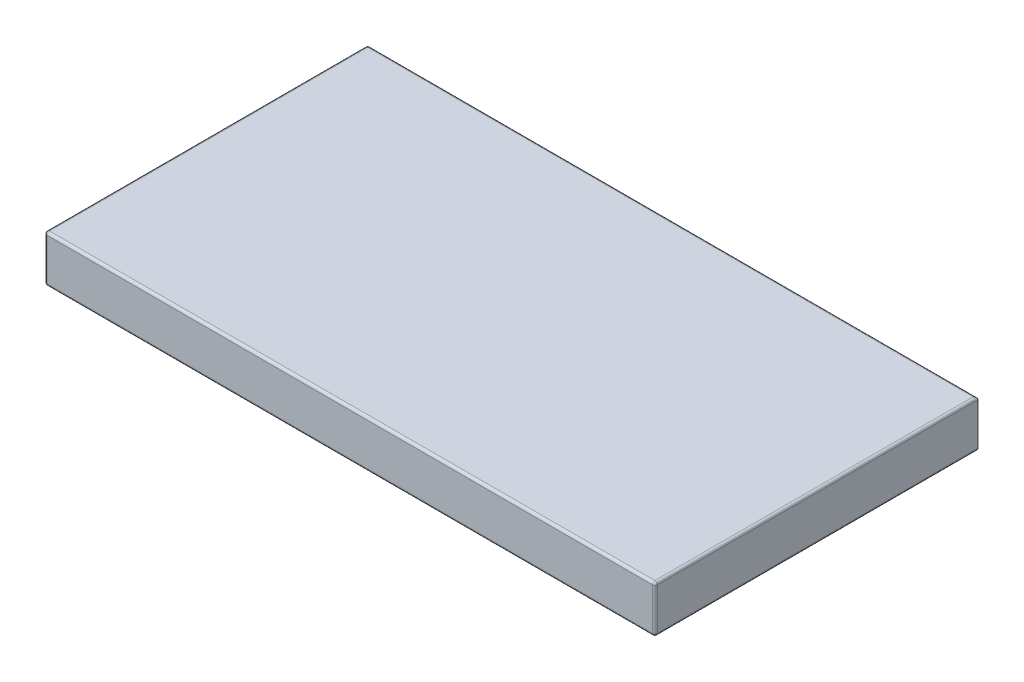
ISO-10303-21;
HEADER;
FILE_DESCRIPTION(('STEP AP214'),'2;1');
FILE_NAME('part.step','',(''),(''),'','','');
FILE_SCHEMA(('AUTOMOTIVE_DESIGN { 1 0 10303 214 1 1 1 1 }'));
ENDSEC;
DATA;
#1=APPLICATION_CONTEXT('core data for automotive mechanical design processes');
#2=APPLICATION_PROTOCOL_DEFINITION('international standard','automotive_design',2000,#1);
#3=PRODUCT_CONTEXT('',#1,'mechanical');
#4=PRODUCT('Part','Part','',(#3));
#5=PRODUCT_RELATED_PRODUCT_CATEGORY('part','',(#4));
#6=PRODUCT_DEFINITION_FORMATION('','',#4);
#7=PRODUCT_DEFINITION_CONTEXT('part definition',#1,'design');
#8=PRODUCT_DEFINITION('design','',#6,#7);
#9=PRODUCT_DEFINITION_SHAPE('','',#8);
#10=(LENGTH_UNIT() NAMED_UNIT(*) SI_UNIT(.MILLI.,.METRE.));
#11=(NAMED_UNIT(*) PLANE_ANGLE_UNIT() SI_UNIT($,.RADIAN.));
#12=(NAMED_UNIT(*) SI_UNIT($,.STERADIAN.) SOLID_ANGLE_UNIT());
#13=UNCERTAINTY_MEASURE_WITH_UNIT(LENGTH_MEASURE(1.E-05),#10,'distance_accuracy_value','');
#14=(GEOMETRIC_REPRESENTATION_CONTEXT(3) GLOBAL_UNCERTAINTY_ASSIGNED_CONTEXT((#13)) GLOBAL_UNIT_ASSIGNED_CONTEXT((#10,
#11,#12)) REPRESENTATION_CONTEXT('',''));
#15=CARTESIAN_POINT('',(0.,0.,0.));
#16=DIRECTION('',(0.,0.,1.));
#17=DIRECTION('',(1.,0.,0.));
#18=AXIS2_PLACEMENT_3D('',#15,#16,#17);
#19=CARTESIAN_POINT('',(0.,9.4,0.));
#20=DIRECTION('',(1.,0.,0.));
#21=DIRECTION('',(0.,0.,-1.));
#22=AXIS2_PLACEMENT_3D('',#19,#20,#21);
#23=PLANE('',#22);
#24=DIRECTION('',(0.,0.,1.));
#25=VECTOR('',#24,1.);
#26=CARTESIAN_POINT('',(0.,8.9,0.));
#27=LINE('',#26,#25);
#28=CARTESIAN_POINT('',(0.,8.9,64.25));
#29=VERTEX_POINT('',#28);
#30=CARTESIAN_POINT('',(0.,8.9,0.5));
#31=VERTEX_POINT('',#30);
#32=EDGE_CURVE('E120',#29,#31,#27,.F.);
#33=ORIENTED_EDGE('',*,*,#32,.T.);
#34=DIRECTION('',(0.,-1.,0.));
#35=VECTOR('',#34,1.);
#36=CARTESIAN_POINT('',(0.,9.4,0.5));
#37=LINE('',#36,#35);
#38=CARTESIAN_POINT('',(0.,0.5,0.5));
#39=VERTEX_POINT('',#38);
#40=EDGE_CURVE('E158',#31,#39,#37,.T.);
#41=ORIENTED_EDGE('',*,*,#40,.T.);
#42=DIRECTION('',(0.,0.,1.));
#43=VECTOR('',#42,1.);
#44=CARTESIAN_POINT('',(0.,0.5,0.));
#45=LINE('',#44,#43);
#46=CARTESIAN_POINT('',(0.,0.5,64.25));
#47=VERTEX_POINT('',#46);
#48=EDGE_CURVE('E123',#39,#47,#45,.T.);
#49=ORIENTED_EDGE('',*,*,#48,.T.);
#50=DIRECTION('',(0.,-1.,0.));
#51=VECTOR('',#50,1.);
#52=CARTESIAN_POINT('',(0.,9.4,64.25));
#53=LINE('',#52,#51);
#54=EDGE_CURVE('E116',#47,#29,#53,.F.);
#55=ORIENTED_EDGE('',*,*,#54,.T.);
#56=EDGE_LOOP('',(#33,#41,#49,#55));
#57=FACE_BOUND('',#56,.T.);
#58=ADVANCED_FACE('F34',(#57),#23,.F.);
#59=CARTESIAN_POINT('',(0.,9.4,64.75));
#60=DIRECTION('',(0.,0.,-1.));
#61=DIRECTION('',(-1.,0.,0.));
#62=AXIS2_PLACEMENT_3D('',#59,#60,#61);
#63=PLANE('',#62);
#64=DIRECTION('',(0.,-1.,0.));
#65=VECTOR('',#64,1.);
#66=CARTESIAN_POINT('',(0.500000000000008,9.4,64.75));
#67=LINE('',#66,#65);
#68=CARTESIAN_POINT('',(0.500000000000008,8.9,64.75));
#69=VERTEX_POINT('',#68);
#70=CARTESIAN_POINT('',(0.500000000000008,0.5,64.75));
#71=VERTEX_POINT('',#70);
#72=EDGE_CURVE('E134',#69,#71,#67,.T.);
#73=ORIENTED_EDGE('',*,*,#72,.T.);
#74=DIRECTION('',(1.,0.,0.));
#75=VECTOR('',#74,1.);
#76=CARTESIAN_POINT('',(0.,0.5,64.75));
#77=LINE('',#76,#75);
#78=CARTESIAN_POINT('',(121.8,0.5,64.75));
#79=VERTEX_POINT('',#78);
#80=EDGE_CURVE('E187',#71,#79,#77,.T.);
#81=ORIENTED_EDGE('',*,*,#80,.T.);
#82=DIRECTION('',(0.,-1.,0.));
#83=VECTOR('',#82,1.);
#84=CARTESIAN_POINT('',(121.8,9.4,64.75));
#85=LINE('',#84,#83);
#86=CARTESIAN_POINT('',(121.8,8.9,64.75));
#87=VERTEX_POINT('',#86);
#88=EDGE_CURVE('E184',#79,#87,#85,.F.);
#89=ORIENTED_EDGE('',*,*,#88,.T.);
#90=DIRECTION('',(1.,0.,0.));
#91=VECTOR('',#90,1.);
#92=CARTESIAN_POINT('',(0.,8.9,64.75));
#93=LINE('',#92,#91);
#94=EDGE_CURVE('E182',#87,#69,#93,.F.);
#95=ORIENTED_EDGE('',*,*,#94,.T.);
#96=EDGE_LOOP('',(#73,#81,#89,#95));
#97=FACE_BOUND('',#96,.T.);
#98=ADVANCED_FACE('F251',(#97),#63,.F.);
#99=CARTESIAN_POINT('',(122.3,9.4,0.));
#100=DIRECTION('',(-1.,0.,0.));
#101=DIRECTION('',(0.,0.,1.));
#102=AXIS2_PLACEMENT_3D('',#99,#100,#101);
#103=PLANE('',#102);
#104=DIRECTION('',(0.,-1.,0.));
#105=VECTOR('',#104,1.);
#106=CARTESIAN_POINT('',(122.3,9.4,64.25));
#107=LINE('',#106,#105);
#108=CARTESIAN_POINT('',(122.3,8.9,64.25));
#109=VERTEX_POINT('',#108);
#110=CARTESIAN_POINT('',(122.3,0.5,64.25));
#111=VERTEX_POINT('',#110);
#112=EDGE_CURVE('E169',#109,#111,#107,.T.);
#113=ORIENTED_EDGE('',*,*,#112,.T.);
#114=DIRECTION('',(0.,0.,-1.));
#115=VECTOR('',#114,1.);
#116=CARTESIAN_POINT('',(122.3,0.5,0.));
#117=LINE('',#116,#115);
#118=CARTESIAN_POINT('',(122.3,0.5,0.));
#119=VERTEX_POINT('',#118);
#120=EDGE_CURVE('E171',#111,#119,#117,.T.);
#121=ORIENTED_EDGE('',*,*,#120,.T.);
#122=DIRECTION('',(0.,-1.,0.));
#123=VECTOR('',#122,1.);
#124=CARTESIAN_POINT('',(122.3,9.4,0.));
#125=LINE('',#124,#123);
#126=CARTESIAN_POINT('',(122.3,8.9,0.));
#127=VERTEX_POINT('',#126);
#128=EDGE_CURVE('E152',#127,#119,#125,.T.);
#129=ORIENTED_EDGE('',*,*,#128,.F.);
#130=DIRECTION('',(0.,0.,-1.));
#131=VECTOR('',#130,1.);
#132=CARTESIAN_POINT('',(122.3,8.9,64.75));
#133=LINE('',#132,#131);
#134=EDGE_CURVE('E167',#127,#109,#133,.F.);
#135=ORIENTED_EDGE('',*,*,#134,.T.);
#136=EDGE_LOOP('',(#113,#121,#129,#135));
#137=FACE_BOUND('',#136,.T.);
#138=ADVANCED_FACE('F270',(#137),#103,.F.);
#139=CARTESIAN_POINT('',(0.,9.4,0.));
#140=DIRECTION('',(0.,0.,1.));
#141=DIRECTION('',(1.,0.,0.));
#142=AXIS2_PLACEMENT_3D('',#139,#140,#141);
#143=PLANE('',#142);
#144=ORIENTED_EDGE('',*,*,#128,.T.);
#145=DIRECTION('',(-1.,0.,0.));
#146=VECTOR('',#145,1.);
#147=CARTESIAN_POINT('',(0.,0.5,0.));
#148=LINE('',#147,#146);
#149=CARTESIAN_POINT('',(0.5,0.5,0.));
#150=VERTEX_POINT('',#149);
#151=EDGE_CURVE('E165',#119,#150,#148,.T.);
#152=ORIENTED_EDGE('',*,*,#151,.T.);
#153=DIRECTION('',(0.,-1.,0.));
#154=VECTOR('',#153,1.);
#155=CARTESIAN_POINT('',(0.5,9.4,0.));
#156=LINE('',#155,#154);
#157=CARTESIAN_POINT('',(0.5,8.9,0.));
#158=VERTEX_POINT('',#157);
#159=EDGE_CURVE('E162',#150,#158,#156,.F.);
#160=ORIENTED_EDGE('',*,*,#159,.T.);
#161=DIRECTION('',(-1.,0.,0.));
#162=VECTOR('',#161,1.);
#163=CARTESIAN_POINT('',(122.3,8.9,0.));
#164=LINE('',#163,#162);
#165=EDGE_CURVE('E160',#158,#127,#164,.F.);
#166=ORIENTED_EDGE('',*,*,#165,.T.);
#167=EDGE_LOOP('',(#144,#152,#160,#166));
#168=FACE_BOUND('',#167,.T.);
#169=ADVANCED_FACE('F272',(#168),#143,.F.);
#170=CARTESIAN_POINT('',(0.,9.4,0.));
#171=DIRECTION('',(0.,1.,0.));
#172=DIRECTION('',(0.,0.,1.));
#173=AXIS2_PLACEMENT_3D('',#170,#171,#172);
#174=PLANE('',#173);
#175=DIRECTION('',(0.,0.,-1.));
#176=VECTOR('',#175,1.);
#177=CARTESIAN_POINT('',(121.8,9.4,0.));
#178=LINE('',#177,#176);
#179=CARTESIAN_POINT('',(121.8,9.4,64.25));
#180=VERTEX_POINT('',#179);
#181=CARTESIAN_POINT('',(121.8,9.4,0.5));
#182=VERTEX_POINT('',#181);
#183=EDGE_CURVE('E43',#180,#182,#178,.T.);
#184=ORIENTED_EDGE('',*,*,#183,.T.);
#185=DIRECTION('',(-1.,0.,0.));
#186=VECTOR('',#185,1.);
#187=CARTESIAN_POINT('',(0.,9.4,0.5));
#188=LINE('',#187,#186);
#189=CARTESIAN_POINT('',(0.5,9.4,0.5));
#190=VERTEX_POINT('',#189);
#191=EDGE_CURVE('E11',#182,#190,#188,.T.);
#192=ORIENTED_EDGE('',*,*,#191,.T.);
#193=DIRECTION('',(0.,0.,1.));
#194=VECTOR('',#193,1.);
#195=CARTESIAN_POINT('',(0.500000000000008,9.4,64.75));
#196=LINE('',#195,#194);
#197=CARTESIAN_POINT('',(0.500000000000008,9.4,64.25));
#198=VERTEX_POINT('',#197);
#199=EDGE_CURVE('E189',#190,#198,#196,.T.);
#200=ORIENTED_EDGE('',*,*,#199,.T.);
#201=DIRECTION('',(1.,0.,0.));
#202=VECTOR('',#201,1.);
#203=CARTESIAN_POINT('',(122.3,9.4,64.25));
#204=LINE('',#203,#202);
#205=EDGE_CURVE('E54',#198,#180,#204,.T.);
#206=ORIENTED_EDGE('',*,*,#205,.T.);
#207=EDGE_LOOP('',(#184,#192,#200,#206));
#208=FACE_BOUND('',#207,.T.);
#209=ADVANCED_FACE('F248',(#208),#174,.T.);
#210=CARTESIAN_POINT('',(0.,0.,0.));
#211=DIRECTION('',(0.,1.,0.));
#212=DIRECTION('',(0.,0.,1.));
#213=AXIS2_PLACEMENT_3D('',#210,#211,#212);
#214=PLANE('',#213);
#215=DIRECTION('',(-1.,0.,0.));
#216=VECTOR('',#215,1.);
#217=CARTESIAN_POINT('',(0.,0.,0.5));
#218=LINE('',#217,#216);
#219=CARTESIAN_POINT('',(0.5,0.,0.5));
#220=VERTEX_POINT('',#219);
#221=CARTESIAN_POINT('',(121.8,0.,0.5));
#222=VERTEX_POINT('',#221);
#223=EDGE_CURVE('E177',#220,#222,#218,.F.);
#224=ORIENTED_EDGE('',*,*,#223,.T.);
#225=DIRECTION('',(0.,0.,-1.));
#226=VECTOR('',#225,1.);
#227=CARTESIAN_POINT('',(121.8,0.,0.));
#228=LINE('',#227,#226);
#229=CARTESIAN_POINT('',(121.8,0.,64.25));
#230=VERTEX_POINT('',#229);
#231=EDGE_CURVE('E179',#222,#230,#228,.F.);
#232=ORIENTED_EDGE('',*,*,#231,.T.);
#233=DIRECTION('',(1.,0.,0.));
#234=VECTOR('',#233,1.);
#235=CARTESIAN_POINT('',(0.,0.,64.25));
#236=LINE('',#235,#234);
#237=CARTESIAN_POINT('',(0.500000000000008,0.,64.25));
#238=VERTEX_POINT('',#237);
#239=EDGE_CURVE('E173',#230,#238,#236,.F.);
#240=ORIENTED_EDGE('',*,*,#239,.T.);
#241=DIRECTION('',(0.,0.,1.));
#242=VECTOR('',#241,1.);
#243=CARTESIAN_POINT('',(0.5,0.,0.));
#244=LINE('',#243,#242);
#245=EDGE_CURVE('E175',#238,#220,#244,.F.);
#246=ORIENTED_EDGE('',*,*,#245,.T.);
#247=EDGE_LOOP('',(#224,#232,#240,#246));
#248=FACE_BOUND('',#247,.T.);
#249=ADVANCED_FACE('F425',(#248),#214,.F.);
#250=CARTESIAN_POINT('',(121.8,9.4,64.25));
#251=DIRECTION('',(0.,-1.,0.));
#252=DIRECTION('',(0.,0.,-1.));
#253=AXIS2_PLACEMENT_3D('',#250,#251,#252);
#254=CYLINDRICAL_SURFACE('',#253,0.5);
#255=CARTESIAN_POINT('',(121.8,8.9,64.25));
#256=DIRECTION('',(0.,1.,0.));
#257=DIRECTION('',(0.,0.,1.));
#258=AXIS2_PLACEMENT_3D('',#255,#256,#257);
#259=CIRCLE('',#258,0.5);
#260=EDGE_CURVE('E38',#87,#109,#259,.T.);
#261=ORIENTED_EDGE('',*,*,#260,.F.);
#262=ORIENTED_EDGE('',*,*,#88,.F.);
#263=CARTESIAN_POINT('',(121.8,0.5,64.25));
#264=DIRECTION('',(0.,-1.,0.));
#265=DIRECTION('',(0.,0.,-1.));
#266=AXIS2_PLACEMENT_3D('',#263,#264,#265);
#267=CIRCLE('',#266,0.5);
#268=EDGE_CURVE('E223',#111,#79,#267,.T.);
#269=ORIENTED_EDGE('',*,*,#268,.F.);
#270=ORIENTED_EDGE('',*,*,#112,.F.);
#271=EDGE_LOOP('',(#261,#262,#269,#270));
#272=FACE_BOUND('',#271,.T.);
#273=ADVANCED_FACE('F36',(#272),#254,.T.);
#274=CARTESIAN_POINT('',(121.8,8.9,64.25));
#275=DIRECTION('',(0.,0.,1.));
#276=DIRECTION('',(1.,0.,0.));
#277=AXIS2_PLACEMENT_3D('',#274,#275,#276);
#278=SPHERICAL_SURFACE('',#277,0.5);
#279=CARTESIAN_POINT('',(121.8,8.9,64.25));
#280=DIRECTION('',(0.,0.,1.));
#281=DIRECTION('',(1.,0.,0.));
#282=AXIS2_PLACEMENT_3D('',#279,#280,#281);
#283=CIRCLE('',#282,0.5);
#284=EDGE_CURVE('E220',#180,#109,#283,.F.);
#285=ORIENTED_EDGE('',*,*,#284,.F.);
#286=CARTESIAN_POINT('',(121.8,8.9,64.25));
#287=DIRECTION('',(1.,0.,0.));
#288=DIRECTION('',(0.,0.,-1.));
#289=AXIS2_PLACEMENT_3D('',#286,#287,#288);
#290=CIRCLE('',#289,0.5);
#291=EDGE_CURVE('E228',#87,#180,#290,.F.);
#292=ORIENTED_EDGE('',*,*,#291,.F.);
#293=ORIENTED_EDGE('',*,*,#260,.T.);
#294=EDGE_LOOP('',(#285,#292,#293));
#295=FACE_BOUND('',#294,.T.);
#296=ADVANCED_FACE('F236',(#295),#278,.T.);
#297=CARTESIAN_POINT('',(0.,8.9,64.25));
#298=DIRECTION('',(-1.,0.,0.));
#299=DIRECTION('',(0.,0.,1.));
#300=AXIS2_PLACEMENT_3D('',#297,#298,#299);
#301=CYLINDRICAL_SURFACE('',#300,0.5);
#302=ORIENTED_EDGE('',*,*,#291,.T.);
#303=ORIENTED_EDGE('',*,*,#205,.F.);
#304=CARTESIAN_POINT('',(0.500000000000008,8.9,64.25));
#305=DIRECTION('',(-1.,0.,0.));
#306=DIRECTION('',(0.,-1.,0.));
#307=AXIS2_PLACEMENT_3D('',#304,#305,#306);
#308=CIRCLE('',#307,0.5);
#309=EDGE_CURVE('E138',#69,#198,#308,.T.);
#310=ORIENTED_EDGE('',*,*,#309,.F.);
#311=ORIENTED_EDGE('',*,*,#94,.F.);
#312=EDGE_LOOP('',(#302,#303,#310,#311));
#313=FACE_BOUND('',#312,.T.);
#314=ADVANCED_FACE('F249',(#313),#301,.T.);
#315=CARTESIAN_POINT('',(0.500000000000008,9.4,64.25));
#316=DIRECTION('',(0.,-1.,0.));
#317=DIRECTION('',(0.,0.,-1.));
#318=AXIS2_PLACEMENT_3D('',#315,#316,#317);
#319=CYLINDRICAL_SURFACE('',#318,0.5);
#320=CARTESIAN_POINT('',(0.500000000000008,0.5,64.25));
#321=DIRECTION('',(0.,-1.,0.));
#322=DIRECTION('',(0.,0.,-1.));
#323=AXIS2_PLACEMENT_3D('',#320,#321,#322);
#324=CIRCLE('',#323,0.5);
#325=EDGE_CURVE('E139',#71,#47,#324,.T.);
#326=ORIENTED_EDGE('',*,*,#325,.F.);
#327=ORIENTED_EDGE('',*,*,#72,.F.);
#328=CARTESIAN_POINT('',(0.500000000000008,8.9,64.25));
#329=DIRECTION('',(0.,1.,0.));
#330=DIRECTION('',(0.,0.,1.));
#331=AXIS2_PLACEMENT_3D('',#328,#329,#330);
#332=CIRCLE('',#331,0.5);
#333=EDGE_CURVE('E130',#29,#69,#332,.T.);
#334=ORIENTED_EDGE('',*,*,#333,.F.);
#335=ORIENTED_EDGE('',*,*,#54,.F.);
#336=EDGE_LOOP('',(#326,#327,#334,#335));
#337=FACE_BOUND('',#336,.T.);
#338=ADVANCED_FACE('F132',(#337),#319,.T.);
#339=CARTESIAN_POINT('',(0.,0.5,64.25));
#340=DIRECTION('',(1.,0.,0.));
#341=DIRECTION('',(0.,0.,-1.));
#342=AXIS2_PLACEMENT_3D('',#339,#340,#341);
#343=CYLINDRICAL_SURFACE('',#342,0.5);
#344=CARTESIAN_POINT('',(121.8,0.5,64.25));
#345=DIRECTION('',(1.,0.,0.));
#346=DIRECTION('',(0.,0.,-1.));
#347=AXIS2_PLACEMENT_3D('',#344,#345,#346);
#348=CIRCLE('',#347,0.5);
#349=EDGE_CURVE('E226',#79,#230,#348,.T.);
#350=ORIENTED_EDGE('',*,*,#349,.F.);
#351=ORIENTED_EDGE('',*,*,#80,.F.);
#352=CARTESIAN_POINT('',(0.500000000000008,0.5,64.25));
#353=DIRECTION('',(-1.,0.,0.));
#354=DIRECTION('',(0.,0.,1.));
#355=AXIS2_PLACEMENT_3D('',#352,#353,#354);
#356=CIRCLE('',#355,0.5);
#357=EDGE_CURVE('E216',#238,#71,#356,.T.);
#358=ORIENTED_EDGE('',*,*,#357,.F.);
#359=ORIENTED_EDGE('',*,*,#239,.F.);
#360=EDGE_LOOP('',(#350,#351,#358,#359));
#361=FACE_BOUND('',#360,.T.);
#362=ADVANCED_FACE('F258',(#361),#343,.T.);
#363=CARTESIAN_POINT('',(121.8,0.5,64.25));
#364=DIRECTION('',(0.,0.,1.));
#365=DIRECTION('',(1.,0.,0.));
#366=AXIS2_PLACEMENT_3D('',#363,#364,#365);
#367=SPHERICAL_SURFACE('',#366,0.5);
#368=ORIENTED_EDGE('',*,*,#268,.T.);
#369=ORIENTED_EDGE('',*,*,#349,.T.);
#370=CARTESIAN_POINT('',(121.8,0.5,64.25));
#371=DIRECTION('',(0.,0.,1.));
#372=DIRECTION('',(1.,0.,0.));
#373=AXIS2_PLACEMENT_3D('',#370,#371,#372);
#374=CIRCLE('',#373,0.5);
#375=EDGE_CURVE('E214',#111,#230,#374,.F.);
#376=ORIENTED_EDGE('',*,*,#375,.F.);
#377=EDGE_LOOP('',(#368,#369,#376));
#378=FACE_BOUND('',#377,.T.);
#379=ADVANCED_FACE('F261',(#378),#367,.T.);
#380=CARTESIAN_POINT('',(121.8,8.9,0.));
#381=DIRECTION('',(0.,0.,1.));
#382=DIRECTION('',(1.,0.,0.));
#383=AXIS2_PLACEMENT_3D('',#380,#381,#382);
#384=CYLINDRICAL_SURFACE('',#383,0.5);
#385=ORIENTED_EDGE('',*,*,#284,.T.);
#386=ORIENTED_EDGE('',*,*,#134,.F.);
#387=CARTESIAN_POINT('',(121.8,8.9,0.5));
#388=DIRECTION('',(0.707106781186548,0.,0.707106781186547));
#389=DIRECTION('',(-0.707106781186547,0.,0.707106781186548));
#390=AXIS2_PLACEMENT_3D('',#387,#388,#389);
#391=ELLIPSE('',#390,0.707106781186547,0.5);
#392=EDGE_CURVE('E146',#182,#127,#391,.F.);
#393=ORIENTED_EDGE('',*,*,#392,.F.);
#394=ORIENTED_EDGE('',*,*,#183,.F.);
#395=EDGE_LOOP('',(#385,#386,#393,#394));
#396=FACE_BOUND('',#395,.T.);
#397=ADVANCED_FACE('F242',(#396),#384,.T.);
#398=CARTESIAN_POINT('',(0.500000000000008,8.9,64.25));
#399=DIRECTION('',(0.,0.,1.));
#400=DIRECTION('',(1.,0.,0.));
#401=AXIS2_PLACEMENT_3D('',#398,#399,#400);
#402=SPHERICAL_SURFACE('',#401,0.5);
#403=ORIENTED_EDGE('',*,*,#333,.T.);
#404=ORIENTED_EDGE('',*,*,#309,.T.);
#405=CARTESIAN_POINT('',(0.500000000000008,8.9,64.25));
#406=DIRECTION('',(0.,0.,1.));
#407=DIRECTION('',(1.,0.,0.));
#408=AXIS2_PLACEMENT_3D('',#405,#406,#407);
#409=CIRCLE('',#408,0.5);
#410=EDGE_CURVE('E142',#29,#198,#409,.F.);
#411=ORIENTED_EDGE('',*,*,#410,.F.);
#412=EDGE_LOOP('',(#403,#404,#411));
#413=FACE_BOUND('',#412,.T.);
#414=ADVANCED_FACE('F143',(#413),#402,.T.);
#415=CARTESIAN_POINT('',(0.500000000000008,0.5,64.25));
#416=DIRECTION('',(0.,0.,1.));
#417=DIRECTION('',(1.,0.,0.));
#418=AXIS2_PLACEMENT_3D('',#415,#416,#417);
#419=SPHERICAL_SURFACE('',#418,0.5);
#420=ORIENTED_EDGE('',*,*,#357,.T.);
#421=ORIENTED_EDGE('',*,*,#325,.T.);
#422=CARTESIAN_POINT('',(0.500000000000008,0.5,64.25));
#423=DIRECTION('',(0.,0.,1.));
#424=DIRECTION('',(1.,0.,0.));
#425=AXIS2_PLACEMENT_3D('',#422,#423,#424);
#426=CIRCLE('',#425,0.5);
#427=EDGE_CURVE('E147',#238,#47,#426,.F.);
#428=ORIENTED_EDGE('',*,*,#427,.F.);
#429=EDGE_LOOP('',(#420,#421,#428));
#430=FACE_BOUND('',#429,.T.);
#431=ADVANCED_FACE('F287',(#430),#419,.T.);
#432=CARTESIAN_POINT('',(121.8,0.5,0.));
#433=DIRECTION('',(0.,0.,-1.));
#434=DIRECTION('',(-1.,0.,0.));
#435=AXIS2_PLACEMENT_3D('',#432,#433,#434);
#436=CYLINDRICAL_SURFACE('',#435,0.5);
#437=ORIENTED_EDGE('',*,*,#375,.T.);
#438=ORIENTED_EDGE('',*,*,#231,.F.);
#439=CARTESIAN_POINT('',(121.8,0.5,0.5));
#440=DIRECTION('',(-0.707106781186548,0.,-0.707106781186547));
#441=DIRECTION('',(-0.707106781186547,0.,0.707106781186548));
#442=AXIS2_PLACEMENT_3D('',#439,#440,#441);
#443=ELLIPSE('',#442,0.707106781186547,0.5);
#444=EDGE_CURVE('E207',#119,#222,#443,.T.);
#445=ORIENTED_EDGE('',*,*,#444,.F.);
#446=ORIENTED_EDGE('',*,*,#120,.F.);
#447=EDGE_LOOP('',(#437,#438,#445,#446));
#448=FACE_BOUND('',#447,.T.);
#449=ADVANCED_FACE('F266',(#448),#436,.T.);
#450=CARTESIAN_POINT('',(0.,8.9,0.5));
#451=DIRECTION('',(1.,0.,0.));
#452=DIRECTION('',(0.,0.,-1.));
#453=AXIS2_PLACEMENT_3D('',#450,#451,#452);
#454=CYLINDRICAL_SURFACE('',#453,0.5);
#455=ORIENTED_EDGE('',*,*,#392,.T.);
#456=ORIENTED_EDGE('',*,*,#165,.F.);
#457=CARTESIAN_POINT('',(0.5,8.9,0.5));
#458=DIRECTION('',(-1.,0.,0.));
#459=DIRECTION('',(0.,0.,1.));
#460=AXIS2_PLACEMENT_3D('',#457,#458,#459);
#461=CIRCLE('',#460,0.5);
#462=EDGE_CURVE('E204',#190,#158,#461,.T.);
#463=ORIENTED_EDGE('',*,*,#462,.F.);
#464=ORIENTED_EDGE('',*,*,#191,.F.);
#465=EDGE_LOOP('',(#455,#456,#463,#464));
#466=FACE_BOUND('',#465,.T.);
#467=ADVANCED_FACE('F247',(#466),#454,.T.);
#468=CARTESIAN_POINT('',(0.5,8.9,0.));
#469=DIRECTION('',(0.,0.,-1.));
#470=DIRECTION('',(-1.,0.,0.));
#471=AXIS2_PLACEMENT_3D('',#468,#469,#470);
#472=CYLINDRICAL_SURFACE('',#471,0.5);
#473=ORIENTED_EDGE('',*,*,#410,.T.);
#474=ORIENTED_EDGE('',*,*,#199,.F.);
#475=CARTESIAN_POINT('',(0.5,8.9,0.5));
#476=DIRECTION('',(0.,0.,-1.));
#477=DIRECTION('',(-1.,0.,0.));
#478=AXIS2_PLACEMENT_3D('',#475,#476,#477);
#479=CIRCLE('',#478,0.5);
#480=EDGE_CURVE('E150',#31,#190,#479,.T.);
#481=ORIENTED_EDGE('',*,*,#480,.F.);
#482=ORIENTED_EDGE('',*,*,#32,.F.);
#483=EDGE_LOOP('',(#473,#474,#481,#482));
#484=FACE_BOUND('',#483,.T.);
#485=ADVANCED_FACE('F149',(#484),#472,.T.);
#486=CARTESIAN_POINT('',(0.5,0.5,0.));
#487=DIRECTION('',(0.,0.,1.));
#488=DIRECTION('',(1.,0.,0.));
#489=AXIS2_PLACEMENT_3D('',#486,#487,#488);
#490=CYLINDRICAL_SURFACE('',#489,0.5);
#491=ORIENTED_EDGE('',*,*,#427,.T.);
#492=ORIENTED_EDGE('',*,*,#48,.F.);
#493=CARTESIAN_POINT('',(0.5,0.5,0.5));
#494=DIRECTION('',(0.,0.,-1.));
#495=DIRECTION('',(-1.,0.,0.));
#496=AXIS2_PLACEMENT_3D('',#493,#494,#495);
#497=CIRCLE('',#496,0.5);
#498=EDGE_CURVE('E200',#220,#39,#497,.T.);
#499=ORIENTED_EDGE('',*,*,#498,.F.);
#500=ORIENTED_EDGE('',*,*,#245,.F.);
#501=EDGE_LOOP('',(#491,#492,#499,#500));
#502=FACE_BOUND('',#501,.T.);
#503=ADVANCED_FACE('F284',(#502),#490,.T.);
#504=CARTESIAN_POINT('',(0.,0.5,0.5));
#505=DIRECTION('',(-1.,0.,0.));
#506=DIRECTION('',(0.,0.,1.));
#507=AXIS2_PLACEMENT_3D('',#504,#505,#506);
#508=CYLINDRICAL_SURFACE('',#507,0.5);
#509=ORIENTED_EDGE('',*,*,#444,.T.);
#510=ORIENTED_EDGE('',*,*,#223,.F.);
#511=CARTESIAN_POINT('',(0.5,0.5,0.5));
#512=DIRECTION('',(-1.,0.,0.));
#513=DIRECTION('',(0.,0.,1.));
#514=AXIS2_PLACEMENT_3D('',#511,#512,#513);
#515=CIRCLE('',#514,0.5);
#516=EDGE_CURVE('E197',#150,#220,#515,.T.);
#517=ORIENTED_EDGE('',*,*,#516,.F.);
#518=ORIENTED_EDGE('',*,*,#151,.F.);
#519=EDGE_LOOP('',(#509,#510,#517,#518));
#520=FACE_BOUND('',#519,.T.);
#521=ADVANCED_FACE('F311',(#520),#508,.T.);
#522=CARTESIAN_POINT('',(0.5,8.9,0.5));
#523=DIRECTION('',(0.,0.,1.));
#524=DIRECTION('',(1.,0.,0.));
#525=AXIS2_PLACEMENT_3D('',#522,#523,#524);
#526=SPHERICAL_SURFACE('',#525,0.5);
#527=ORIENTED_EDGE('',*,*,#480,.T.);
#528=ORIENTED_EDGE('',*,*,#462,.T.);
#529=CARTESIAN_POINT('',(0.5,8.9,0.5));
#530=DIRECTION('',(0.,1.,0.));
#531=DIRECTION('',(0.,0.,1.));
#532=AXIS2_PLACEMENT_3D('',#529,#530,#531);
#533=CIRCLE('',#532,0.5);
#534=EDGE_CURVE('E195',#31,#158,#533,.F.);
#535=ORIENTED_EDGE('',*,*,#534,.F.);
#536=EDGE_LOOP('',(#527,#528,#535));
#537=FACE_BOUND('',#536,.T.);
#538=ADVANCED_FACE('F308',(#537),#526,.T.);
#539=CARTESIAN_POINT('',(0.5,0.5,0.5));
#540=DIRECTION('',(0.,0.,1.));
#541=DIRECTION('',(1.,0.,0.));
#542=AXIS2_PLACEMENT_3D('',#539,#540,#541);
#543=SPHERICAL_SURFACE('',#542,0.5);
#544=ORIENTED_EDGE('',*,*,#516,.T.);
#545=ORIENTED_EDGE('',*,*,#498,.T.);
#546=CARTESIAN_POINT('',(0.5,0.5,0.5));
#547=DIRECTION('',(0.,-1.,0.));
#548=DIRECTION('',(0.,0.,-1.));
#549=AXIS2_PLACEMENT_3D('',#546,#547,#548);
#550=CIRCLE('',#549,0.5);
#551=EDGE_CURVE('E193',#150,#39,#550,.F.);
#552=ORIENTED_EDGE('',*,*,#551,.F.);
#553=EDGE_LOOP('',(#544,#545,#552));
#554=FACE_BOUND('',#553,.T.);
#555=ADVANCED_FACE('F280',(#554),#543,.T.);
#556=CARTESIAN_POINT('',(0.5,9.4,0.5));
#557=DIRECTION('',(0.,-1.,0.));
#558=DIRECTION('',(0.,0.,-1.));
#559=AXIS2_PLACEMENT_3D('',#556,#557,#558);
#560=CYLINDRICAL_SURFACE('',#559,0.5);
#561=ORIENTED_EDGE('',*,*,#534,.T.);
#562=ORIENTED_EDGE('',*,*,#159,.F.);
#563=ORIENTED_EDGE('',*,*,#551,.T.);
#564=ORIENTED_EDGE('',*,*,#40,.F.);
#565=EDGE_LOOP('',(#561,#562,#563,#564));
#566=FACE_BOUND('',#565,.T.);
#567=ADVANCED_FACE('F277',(#566),#560,.T.);
#568=CLOSED_SHELL('',(#58,#98,#138,#169,#209,#249,#273,#296,#314,#338,#362,#379,#397,#414,#431,
#449,#467,#485,#503,#521,#538,#555,#567));
#569=MANIFOLD_SOLID_BREP('B2',#568);
#570=ADVANCED_BREP_SHAPE_REPRESENTATION('',(#18,#569),#14);
#571=SHAPE_DEFINITION_REPRESENTATION(#9,#570);
ENDSEC;
END-ISO-10303-21;
